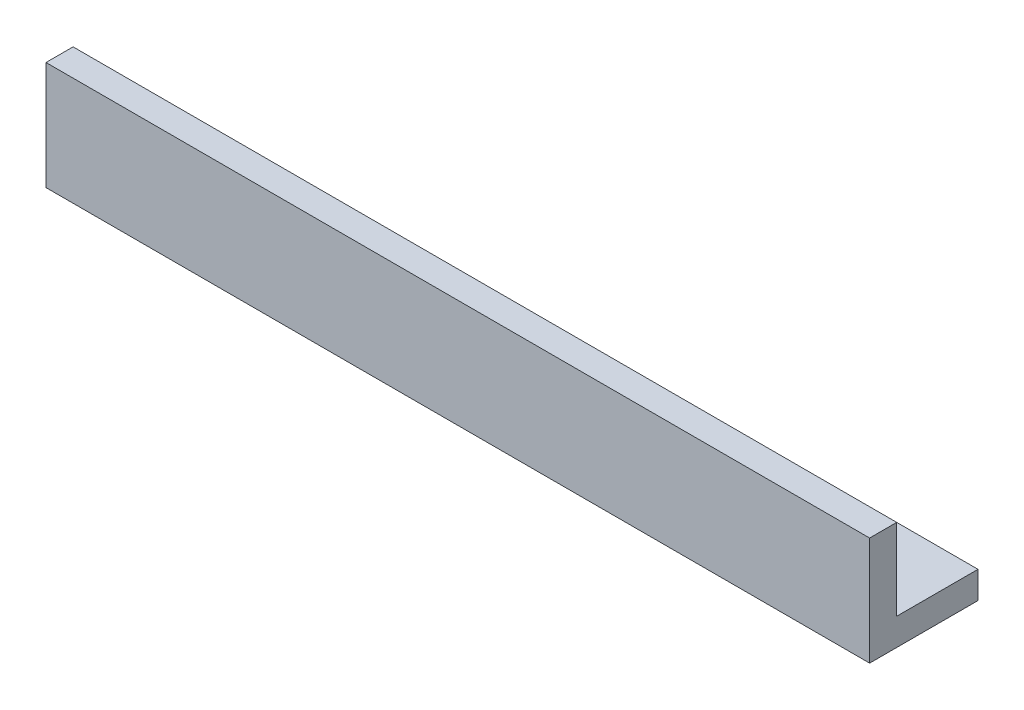
ISO-10303-21;
HEADER;
FILE_DESCRIPTION(('STEP AP214'),'2;1');
FILE_NAME('part.step','',(''),(''),'','','');
FILE_SCHEMA(('AUTOMOTIVE_DESIGN { 1 0 10303 214 1 1 1 1 }'));
ENDSEC;
DATA;
#1=APPLICATION_CONTEXT('core data for automotive mechanical design processes');
#2=APPLICATION_PROTOCOL_DEFINITION('international standard','automotive_design',2000,#1);
#3=PRODUCT_CONTEXT('',#1,'mechanical');
#4=PRODUCT('Part','Part','',(#3));
#5=PRODUCT_RELATED_PRODUCT_CATEGORY('part','',(#4));
#6=PRODUCT_DEFINITION_FORMATION('','',#4);
#7=PRODUCT_DEFINITION_CONTEXT('part definition',#1,'design');
#8=PRODUCT_DEFINITION('design','',#6,#7);
#9=PRODUCT_DEFINITION_SHAPE('','',#8);
#10=(LENGTH_UNIT() NAMED_UNIT(*) SI_UNIT(.MILLI.,.METRE.));
#11=(NAMED_UNIT(*) PLANE_ANGLE_UNIT() SI_UNIT($,.RADIAN.));
#12=(NAMED_UNIT(*) SI_UNIT($,.STERADIAN.) SOLID_ANGLE_UNIT());
#13=UNCERTAINTY_MEASURE_WITH_UNIT(LENGTH_MEASURE(1.E-05),#10,'distance_accuracy_value','');
#14=(GEOMETRIC_REPRESENTATION_CONTEXT(3) GLOBAL_UNCERTAINTY_ASSIGNED_CONTEXT((#13)) GLOBAL_UNIT_ASSIGNED_CONTEXT((#10,
#11,#12)) REPRESENTATION_CONTEXT('',''));
#15=CARTESIAN_POINT('',(0.,0.,0.));
#16=DIRECTION('',(0.,0.,1.));
#17=DIRECTION('',(1.,0.,0.));
#18=AXIS2_PLACEMENT_3D('',#15,#16,#17);
#19=CARTESIAN_POINT('',(-24.7335273568716,28.7042734044365,3.175));
#20=DIRECTION('',(1.,0.,0.));
#21=DIRECTION('',(0.,0.,-1.));
#22=AXIS2_PLACEMENT_3D('',#19,#20,#21);
#23=PLANE('',#22);
#24=DIRECTION('',(0.,-1.,0.));
#25=VECTOR('',#24,1.);
#26=CARTESIAN_POINT('',(-24.7335273568716,28.7042734044365,0.));
#27=LINE('',#26,#25);
#28=CARTESIAN_POINT('',(-24.7335273568716,28.7042734044365,0.));
#29=VERTEX_POINT('',#28);
#30=CARTESIAN_POINT('',(-24.7335273568716,19.1792734044365,0.));
#31=VERTEX_POINT('',#30);
#32=EDGE_CURVE('E134',#29,#31,#27,.T.);
#33=ORIENTED_EDGE('',*,*,#32,.T.);
#34=DIRECTION('',(0.,0.,-1.));
#35=VECTOR('',#34,1.);
#36=CARTESIAN_POINT('',(-24.7335273568716,19.1792734044365,-9.525));
#37=LINE('',#36,#35);
#38=CARTESIAN_POINT('',(-24.7335273568716,19.1792734044365,-9.525));
#39=VERTEX_POINT('',#38);
#40=EDGE_CURVE('E57',#31,#39,#37,.T.);
#41=ORIENTED_EDGE('',*,*,#40,.T.);
#42=DIRECTION('',(0.,-1.,0.));
#43=VECTOR('',#42,1.);
#44=CARTESIAN_POINT('',(-24.7335273568716,19.1792734044365,-9.525));
#45=LINE('',#44,#43);
#46=CARTESIAN_POINT('',(-24.7335273568716,16.0042734044365,-9.525));
#47=VERTEX_POINT('',#46);
#48=EDGE_CURVE('E115',#39,#47,#45,.T.);
#49=ORIENTED_EDGE('',*,*,#48,.T.);
#50=DIRECTION('',(0.,0.,-1.));
#51=VECTOR('',#50,1.);
#52=CARTESIAN_POINT('',(-24.7335273568716,16.0042734044365,3.175));
#53=LINE('',#52,#51);
#54=CARTESIAN_POINT('',(-24.7335273568716,16.0042734044365,3.175));
#55=VERTEX_POINT('',#54);
#56=EDGE_CURVE('E11',#55,#47,#53,.T.);
#57=ORIENTED_EDGE('',*,*,#56,.F.);
#58=DIRECTION('',(0.,-1.,0.));
#59=VECTOR('',#58,1.);
#60=CARTESIAN_POINT('',(-24.7335273568716,28.7042734044365,3.175));
#61=LINE('',#60,#59);
#62=CARTESIAN_POINT('',(-24.7335273568716,28.7042734044365,3.175));
#63=VERTEX_POINT('',#62);
#64=EDGE_CURVE('E147',#63,#55,#61,.T.);
#65=ORIENTED_EDGE('',*,*,#64,.F.);
#66=DIRECTION('',(0.,0.,-1.));
#67=VECTOR('',#66,1.);
#68=CARTESIAN_POINT('',(-24.7335273568716,28.7042734044365,3.175));
#69=LINE('',#68,#67);
#70=EDGE_CURVE('E157',#63,#29,#69,.T.);
#71=ORIENTED_EDGE('',*,*,#70,.T.);
#72=EDGE_LOOP('',(#33,#41,#49,#57,#65,#71));
#73=FACE_BOUND('',#72,.T.);
#74=ADVANCED_FACE('F39',(#73),#23,.F.);
#75=CARTESIAN_POINT('',(-24.7335273568716,16.0042734044365,3.175));
#76=DIRECTION('',(0.,1.,0.));
#77=DIRECTION('',(-1.,0.,0.));
#78=AXIS2_PLACEMENT_3D('',#75,#76,#77);
#79=PLANE('',#78);
#80=ORIENTED_EDGE('',*,*,#56,.T.);
#81=DIRECTION('',(1.,0.,0.));
#82=VECTOR('',#81,1.);
#83=CARTESIAN_POINT('',(-24.7335273568716,16.0042734044365,-9.525));
#84=LINE('',#83,#82);
#85=CARTESIAN_POINT('',(71.7864726431284,16.0042734044365,-9.52499999999998));
#86=VERTEX_POINT('',#85);
#87=EDGE_CURVE('E120',#47,#86,#84,.T.);
#88=ORIENTED_EDGE('',*,*,#87,.T.);
#89=DIRECTION('',(0.,0.,-1.));
#90=VECTOR('',#89,1.);
#91=CARTESIAN_POINT('',(71.7864726431284,16.0042734044365,3.175));
#92=LINE('',#91,#90);
#93=CARTESIAN_POINT('',(71.7864726431284,16.0042734044365,3.175));
#94=VERTEX_POINT('',#93);
#95=EDGE_CURVE('E47',#94,#86,#92,.T.);
#96=ORIENTED_EDGE('',*,*,#95,.F.);
#97=DIRECTION('',(1.,0.,0.));
#98=VECTOR('',#97,1.);
#99=CARTESIAN_POINT('',(-24.7335273568716,16.0042734044365,3.175));
#100=LINE('',#99,#98);
#101=EDGE_CURVE('E92',#55,#94,#100,.T.);
#102=ORIENTED_EDGE('',*,*,#101,.F.);
#103=EDGE_LOOP('',(#80,#88,#96,#102));
#104=FACE_BOUND('',#103,.T.);
#105=ADVANCED_FACE('F173',(#104),#79,.F.);
#106=CARTESIAN_POINT('',(71.7864726431284,28.7042734044365,3.175));
#107=DIRECTION('',(-1.,0.,0.));
#108=DIRECTION('',(0.,0.,1.));
#109=AXIS2_PLACEMENT_3D('',#106,#107,#108);
#110=PLANE('',#109);
#111=ORIENTED_EDGE('',*,*,#95,.T.);
#112=DIRECTION('',(0.,-1.,0.));
#113=VECTOR('',#112,1.);
#114=CARTESIAN_POINT('',(71.7864726431284,19.1792734044365,-9.52499999999998));
#115=LINE('',#114,#113);
#116=CARTESIAN_POINT('',(71.7864726431284,19.1792734044365,-9.52499999999998));
#117=VERTEX_POINT('',#116);
#118=EDGE_CURVE('E124',#117,#86,#115,.T.);
#119=ORIENTED_EDGE('',*,*,#118,.F.);
#120=DIRECTION('',(0.,0.,1.));
#121=VECTOR('',#120,1.);
#122=CARTESIAN_POINT('',(71.7864726431284,19.1792734044365,-9.52499999999998));
#123=LINE('',#122,#121);
#124=CARTESIAN_POINT('',(71.7864726431284,19.1792734044365,0.));
#125=VERTEX_POINT('',#124);
#126=EDGE_CURVE('E129',#117,#125,#123,.T.);
#127=ORIENTED_EDGE('',*,*,#126,.T.);
#128=DIRECTION('',(0.,1.,0.));
#129=VECTOR('',#128,1.);
#130=CARTESIAN_POINT('',(71.7864726431284,28.7042734044365,0.));
#131=LINE('',#130,#129);
#132=CARTESIAN_POINT('',(71.7864726431284,28.7042734044365,0.));
#133=VERTEX_POINT('',#132);
#134=EDGE_CURVE('E159',#125,#133,#131,.T.);
#135=ORIENTED_EDGE('',*,*,#134,.T.);
#136=DIRECTION('',(0.,0.,-1.));
#137=VECTOR('',#136,1.);
#138=CARTESIAN_POINT('',(71.7864726431284,28.7042734044365,3.175));
#139=LINE('',#138,#137);
#140=CARTESIAN_POINT('',(71.7864726431284,28.7042734044365,3.175));
#141=VERTEX_POINT('',#140);
#142=EDGE_CURVE('E166',#141,#133,#139,.T.);
#143=ORIENTED_EDGE('',*,*,#142,.F.);
#144=DIRECTION('',(0.,1.,0.));
#145=VECTOR('',#144,1.);
#146=CARTESIAN_POINT('',(71.7864726431284,28.7042734044365,3.175));
#147=LINE('',#146,#145);
#148=EDGE_CURVE('E152',#94,#141,#147,.T.);
#149=ORIENTED_EDGE('',*,*,#148,.F.);
#150=EDGE_LOOP('',(#111,#119,#127,#135,#143,#149));
#151=FACE_BOUND('',#150,.T.);
#152=ADVANCED_FACE('F171',(#151),#110,.F.);
#153=CARTESIAN_POINT('',(-24.7335273568716,28.7042734044365,3.175));
#154=DIRECTION('',(0.,-1.,0.));
#155=DIRECTION('',(0.,0.,-1.));
#156=AXIS2_PLACEMENT_3D('',#153,#154,#155);
#157=PLANE('',#156);
#158=DIRECTION('',(-1.,0.,0.));
#159=VECTOR('',#158,1.);
#160=CARTESIAN_POINT('',(-24.7335273568716,28.7042734044365,0.));
#161=LINE('',#160,#159);
#162=EDGE_CURVE('E85',#133,#29,#161,.T.);
#163=ORIENTED_EDGE('',*,*,#162,.T.);
#164=ORIENTED_EDGE('',*,*,#70,.F.);
#165=DIRECTION('',(-1.,0.,0.));
#166=VECTOR('',#165,1.);
#167=CARTESIAN_POINT('',(-24.7335273568716,28.7042734044365,3.175));
#168=LINE('',#167,#166);
#169=EDGE_CURVE('E68',#141,#63,#168,.T.);
#170=ORIENTED_EDGE('',*,*,#169,.F.);
#171=ORIENTED_EDGE('',*,*,#142,.T.);
#172=EDGE_LOOP('',(#163,#164,#170,#171));
#173=FACE_BOUND('',#172,.T.);
#174=ADVANCED_FACE('F177',(#173),#157,.F.);
#175=CARTESIAN_POINT('',(0.,0.,3.175));
#176=DIRECTION('',(0.,0.,1.));
#177=DIRECTION('',(1.,0.,0.));
#178=AXIS2_PLACEMENT_3D('',#175,#176,#177);
#179=PLANE('',#178);
#180=ORIENTED_EDGE('',*,*,#64,.T.);
#181=ORIENTED_EDGE('',*,*,#101,.T.);
#182=ORIENTED_EDGE('',*,*,#148,.T.);
#183=ORIENTED_EDGE('',*,*,#169,.T.);
#184=EDGE_LOOP('',(#180,#181,#182,#183));
#185=FACE_BOUND('',#184,.T.);
#186=ADVANCED_FACE('F175',(#185),#179,.T.);
#187=CARTESIAN_POINT('',(0.,0.,0.));
#188=DIRECTION('',(0.,0.,1.));
#189=DIRECTION('',(1.,0.,0.));
#190=AXIS2_PLACEMENT_3D('',#187,#188,#189);
#191=PLANE('',#190);
#192=ORIENTED_EDGE('',*,*,#134,.F.);
#193=DIRECTION('',(-1.,0.,0.));
#194=VECTOR('',#193,1.);
#195=CARTESIAN_POINT('',(-24.7335273568716,19.1792734044365,0.));
#196=LINE('',#195,#194);
#197=EDGE_CURVE('E125',#125,#31,#196,.T.);
#198=ORIENTED_EDGE('',*,*,#197,.T.);
#199=ORIENTED_EDGE('',*,*,#32,.F.);
#200=ORIENTED_EDGE('',*,*,#162,.F.);
#201=EDGE_LOOP('',(#192,#198,#199,#200));
#202=FACE_BOUND('',#201,.T.);
#203=ADVANCED_FACE('F184',(#202),#191,.F.);
#204=CARTESIAN_POINT('',(-24.7335273568716,19.1792734044365,-9.525));
#205=DIRECTION('',(0.,0.,-1.));
#206=DIRECTION('',(-1.,0.,0.));
#207=AXIS2_PLACEMENT_3D('',#204,#205,#206);
#208=PLANE('',#207);
#209=ORIENTED_EDGE('',*,*,#87,.F.);
#210=ORIENTED_EDGE('',*,*,#48,.F.);
#211=DIRECTION('',(1.,0.,0.));
#212=VECTOR('',#211,1.);
#213=CARTESIAN_POINT('',(-24.7335273568716,19.1792734044365,-9.525));
#214=LINE('',#213,#212);
#215=EDGE_CURVE('E118',#39,#117,#214,.T.);
#216=ORIENTED_EDGE('',*,*,#215,.T.);
#217=ORIENTED_EDGE('',*,*,#118,.T.);
#218=EDGE_LOOP('',(#209,#210,#216,#217));
#219=FACE_BOUND('',#218,.T.);
#220=ADVANCED_FACE('F116',(#219),#208,.T.);
#221=CARTESIAN_POINT('',(0.,19.1792734044365,0.));
#222=DIRECTION('',(0.,1.,0.));
#223=DIRECTION('',(0.,0.,1.));
#224=AXIS2_PLACEMENT_3D('',#221,#222,#223);
#225=PLANE('',#224);
#226=ORIENTED_EDGE('',*,*,#40,.F.);
#227=ORIENTED_EDGE('',*,*,#197,.F.);
#228=ORIENTED_EDGE('',*,*,#126,.F.);
#229=ORIENTED_EDGE('',*,*,#215,.F.);
#230=EDGE_LOOP('',(#226,#227,#228,#229));
#231=FACE_BOUND('',#230,.T.);
#232=ADVANCED_FACE('F128',(#231),#225,.T.);
#233=CLOSED_SHELL('',(#74,#105,#152,#174,#186,#203,#220,#232));
#234=MANIFOLD_SOLID_BREP('B2',#233);
#235=ADVANCED_BREP_SHAPE_REPRESENTATION('',(#18,#234),#14);
#236=SHAPE_DEFINITION_REPRESENTATION(#9,#235);
ENDSEC;
END-ISO-10303-21;
